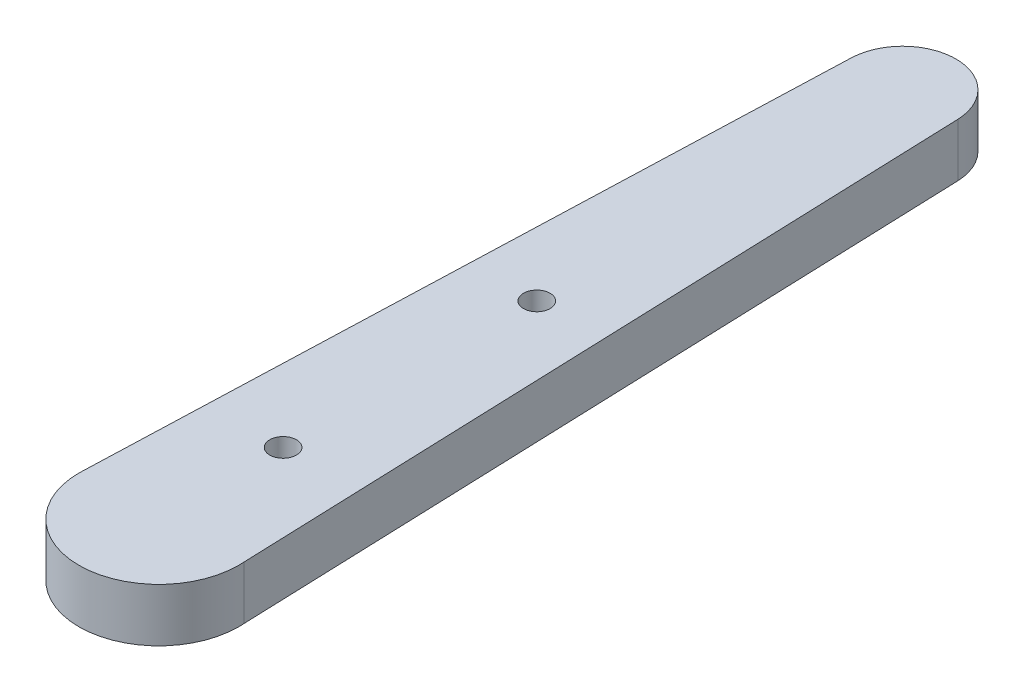
ISO-10303-21;
HEADER;
FILE_DESCRIPTION(('STEP AP214'),'2;1');
FILE_NAME('part.step','',(''),(''),'','','');
FILE_SCHEMA(('AUTOMOTIVE_DESIGN { 1 0 10303 214 1 1 1 1 }'));
ENDSEC;
DATA;
#1=APPLICATION_CONTEXT('core data for automotive mechanical design processes');
#2=APPLICATION_PROTOCOL_DEFINITION('international standard','automotive_design',2000,#1);
#3=PRODUCT_CONTEXT('',#1,'mechanical');
#4=PRODUCT('Part','Part','',(#3));
#5=PRODUCT_RELATED_PRODUCT_CATEGORY('part','',(#4));
#6=PRODUCT_DEFINITION_FORMATION('','',#4);
#7=PRODUCT_DEFINITION_CONTEXT('part definition',#1,'design');
#8=PRODUCT_DEFINITION('design','',#6,#7);
#9=PRODUCT_DEFINITION_SHAPE('','',#8);
#10=(LENGTH_UNIT() NAMED_UNIT(*) SI_UNIT(.MILLI.,.METRE.));
#11=(NAMED_UNIT(*) PLANE_ANGLE_UNIT() SI_UNIT($,.RADIAN.));
#12=(NAMED_UNIT(*) SI_UNIT($,.STERADIAN.) SOLID_ANGLE_UNIT());
#13=UNCERTAINTY_MEASURE_WITH_UNIT(LENGTH_MEASURE(1.E-05),#10,'distance_accuracy_value','');
#14=(GEOMETRIC_REPRESENTATION_CONTEXT(3) GLOBAL_UNCERTAINTY_ASSIGNED_CONTEXT((#13)) GLOBAL_UNIT_ASSIGNED_CONTEXT((#10,
#11,#12)) REPRESENTATION_CONTEXT('',''));
#15=CARTESIAN_POINT('',(0.,0.,0.));
#16=DIRECTION('',(0.,0.,1.));
#17=DIRECTION('',(1.,0.,0.));
#18=AXIS2_PLACEMENT_3D('',#15,#16,#17);
#19=CARTESIAN_POINT('',(0.,2.,0.));
#20=DIRECTION('',(0.,1.,0.));
#21=DIRECTION('',(0.,0.,1.));
#22=AXIS2_PLACEMENT_3D('',#19,#20,#21);
#23=PLANE('',#22);
#24=CARTESIAN_POINT('',(-0.000203324484305146,2.,-14.1900999985433));
#25=DIRECTION('',(0.,1.,0.));
#26=DIRECTION('',(0.,0.,1.));
#27=AXIS2_PLACEMENT_3D('',#24,#25,#26);
#28=CIRCLE('',#27,0.5);
#29=CARTESIAN_POINT('',(-0.000203324484305146,2.,-13.6900999985433));
#30=VERTEX_POINT('',#29);
#31=EDGE_CURVE('E269',#30,#30,#28,.T.);
#32=ORIENTED_EDGE('',*,*,#31,.F.);
#33=EDGE_LOOP('',(#32));
#34=FACE_BOUND('',#33,.T.);
#35=CARTESIAN_POINT('',(-6.68444233435889E-05,2.,-4.6650999995211));
#36=DIRECTION('',(0.,1.,0.));
#37=DIRECTION('',(0.,0.,1.));
#38=AXIS2_PLACEMENT_3D('',#35,#36,#37);
#39=CIRCLE('',#38,0.5);
#40=CARTESIAN_POINT('',(-6.68444233435889E-05,2.,-4.1650999995211));
#41=VERTEX_POINT('',#40);
#42=EDGE_CURVE('E264',#41,#41,#39,.T.);
#43=ORIENTED_EDGE('',*,*,#42,.F.);
#44=EDGE_LOOP('',(#43));
#45=FACE_BOUND('',#44,.T.);
#46=CARTESIAN_POINT('',(-2.99234136236088,2.,-0.214226914985556));
#47=DIRECTION('',(-0.0357284710009022,0.,0.999361534360783));
#48=VECTOR('',#47,1.);
#49=LINE('',#46,#48);
#50=CARTESIAN_POINT('',(-2.99234136236088,2.,-0.214226914985556));
#51=VERTEX_POINT('',#50);
#52=CARTESIAN_POINT('',(-2.99999999999169,2.,-7.06063894732932E-06));
#53=VERTEX_POINT('',#52);
#54=EDGE_CURVE('E11',#51,#53,#49,.T.);
#55=ORIENTED_EDGE('',*,*,#54,.T.);
#56=CARTESIAN_POINT('',(0.,2.,0.));
#57=DIRECTION('',(0.,1.,0.));
#58=DIRECTION('',(0.,0.,1.));
#59=AXIS2_PLACEMENT_3D('',#56,#57,#58);
#60=CIRCLE('',#59,3.);
#61=CARTESIAN_POINT('',(2.99999999999169,2.,7.06063893717848E-06));
#62=VERTEX_POINT('',#61);
#63=EDGE_CURVE('E157',#53,#62,#60,.T.);
#64=ORIENTED_EDGE('',*,*,#63,.T.);
#65=CARTESIAN_POINT('',(2.99999999999169,2.,7.06063893724624E-06));
#66=DIRECTION('',(-0.0357569907916927,0.,-0.999360514333803));
#67=VECTOR('',#66,1.);
#68=LINE('',#65,#67);
#69=CARTESIAN_POINT('',(2.99232812103734,2.,-0.214411790835103));
#70=VERTEX_POINT('',#69);
#71=EDGE_CURVE('E52',#62,#70,#68,.T.);
#72=ORIENTED_EDGE('',*,*,#71,.T.);
#73=DIRECTION('',(-0.0357569907916934,0.,-0.999360514333803));
#74=VECTOR('',#73,1.);
#75=CARTESIAN_POINT('',(2.99616406051452,2.,-0.107202365098083));
#76=LINE('',#75,#74);
#77=CARTESIAN_POINT('',(1.99832079598374,2.,-27.9955994585597));
#78=VERTEX_POINT('',#77);
#79=EDGE_CURVE('E142',#70,#78,#76,.T.);
#80=ORIENTED_EDGE('',*,*,#79,.T.);
#81=CARTESIAN_POINT('',(-0.000400232683862891,2.,-27.9240854769763));
#82=DIRECTION('',(0.,1.,0.));
#83=DIRECTION('',(0.,0.,1.));
#84=AXIS2_PLACEMENT_3D('',#81,#82,#83);
#85=CIRCLE('',#84,2.);
#86=CARTESIAN_POINT('',(-1.99912330140543,2.,-27.9955424189781));
#87=VERTEX_POINT('',#86);
#88=EDGE_CURVE('E118',#87,#78,#85,.F.);
#89=ORIENTED_EDGE('',*,*,#88,.F.);
#90=DIRECTION('',(0.0357284710009011,0.,-0.999361534360783));
#91=VECTOR('',#90,1.);
#92=CARTESIAN_POINT('',(-2.99617068117629,2.,-0.107116987812252));
#93=LINE('',#92,#91);
#94=EDGE_CURVE('E63',#51,#87,#93,.T.);
#95=ORIENTED_EDGE('',*,*,#94,.F.);
#96=EDGE_LOOP('',(#55,#64,#72,#80,#89,#95));
#97=FACE_BOUND('',#96,.T.);
#98=ADVANCED_FACE('F40',(#34,#45,#97),#23,.T.);
#99=CARTESIAN_POINT('',(0.,0.,0.));
#100=DIRECTION('',(0.,1.,0.));
#101=DIRECTION('',(0.,0.,1.));
#102=AXIS2_PLACEMENT_3D('',#99,#100,#101);
#103=PLANE('',#102);
#104=CARTESIAN_POINT('',(-0.000203324484305146,0.,-14.1900999985433));
#105=DIRECTION('',(0.,1.,0.));
#106=DIRECTION('',(0.,0.,1.));
#107=AXIS2_PLACEMENT_3D('',#104,#105,#106);
#108=CIRCLE('',#107,0.5);
#109=CARTESIAN_POINT('',(-0.000203324484305146,0.,-13.6900999985433));
#110=VERTEX_POINT('',#109);
#111=EDGE_CURVE('E145',#110,#110,#108,.T.);
#112=ORIENTED_EDGE('',*,*,#111,.T.);
#113=EDGE_LOOP('',(#112));
#114=FACE_BOUND('',#113,.T.);
#115=CARTESIAN_POINT('',(-6.68444233435889E-05,0.,-4.6650999995211));
#116=DIRECTION('',(0.,1.,0.));
#117=DIRECTION('',(0.,0.,1.));
#118=AXIS2_PLACEMENT_3D('',#115,#116,#117);
#119=CIRCLE('',#118,0.5);
#120=CARTESIAN_POINT('',(-6.68444233435889E-05,0.,-4.1650999995211));
#121=VERTEX_POINT('',#120);
#122=EDGE_CURVE('E261',#121,#121,#119,.T.);
#123=ORIENTED_EDGE('',*,*,#122,.T.);
#124=EDGE_LOOP('',(#123));
#125=FACE_BOUND('',#124,.T.);
#126=CARTESIAN_POINT('',(0.,0.,0.));
#127=DIRECTION('',(0.,1.,0.));
#128=DIRECTION('',(0.,0.,1.));
#129=AXIS2_PLACEMENT_3D('',#126,#127,#128);
#130=CIRCLE('',#129,3.);
#131=CARTESIAN_POINT('',(-2.99999999999169,0.,-7.06063894732932E-06));
#132=VERTEX_POINT('',#131);
#133=CARTESIAN_POINT('',(2.99999999999169,0.,7.06063893717848E-06));
#134=VERTEX_POINT('',#133);
#135=EDGE_CURVE('E138',#132,#134,#130,.T.);
#136=ORIENTED_EDGE('',*,*,#135,.F.);
#137=CARTESIAN_POINT('',(0.,0.,0.));
#138=DIRECTION('',(0.,1.,0.));
#139=DIRECTION('',(-0.99744712078696,0.,-0.0714089716618521));
#140=AXIS2_PLACEMENT_3D('',#137,#138,#139);
#141=CIRCLE('',#140,3.);
#142=CARTESIAN_POINT('',(-2.99234136236088,0.,-0.214226914985556));
#143=VERTEX_POINT('',#142);
#144=EDGE_CURVE('E214',#143,#132,#141,.T.);
#145=ORIENTED_EDGE('',*,*,#144,.F.);
#146=DIRECTION('',(0.0357284710009011,0.,-0.999361534360783));
#147=VECTOR('',#146,1.);
#148=CARTESIAN_POINT('',(-2.99617068117629,0.,-0.107116987812252));
#149=LINE('',#148,#147);
#150=CARTESIAN_POINT('',(-1.99912330140543,0.,-27.9955424189781));
#151=VERTEX_POINT('',#150);
#152=EDGE_CURVE('E111',#143,#151,#149,.T.);
#153=ORIENTED_EDGE('',*,*,#152,.T.);
#154=CARTESIAN_POINT('',(-0.000400232683862891,0.,-27.9240854769763));
#155=DIRECTION('',(0.,1.,0.));
#156=DIRECTION('',(0.,0.,1.));
#157=AXIS2_PLACEMENT_3D('',#154,#155,#156);
#158=CIRCLE('',#157,2.);
#159=CARTESIAN_POINT('',(1.99832079598374,0.,-27.9955994585597));
#160=VERTEX_POINT('',#159);
#161=EDGE_CURVE('E106',#151,#160,#158,.F.);
#162=ORIENTED_EDGE('',*,*,#161,.T.);
#163=DIRECTION('',(-0.0357569907916934,0.,-0.999360514333803));
#164=VECTOR('',#163,1.);
#165=CARTESIAN_POINT('',(2.99616406051452,0.,-0.107202365098083));
#166=LINE('',#165,#164);
#167=CARTESIAN_POINT('',(2.99232812103734,0.,-0.214411790835103));
#168=VERTEX_POINT('',#167);
#169=EDGE_CURVE('E95',#168,#160,#166,.T.);
#170=ORIENTED_EDGE('',*,*,#169,.F.);
#171=CARTESIAN_POINT('',(0.,0.,0.));
#172=DIRECTION('',(0.,1.,0.));
#173=DIRECTION('',(0.99999999999723,0.,2.35354631244232E-06));
#174=AXIS2_PLACEMENT_3D('',#171,#172,#173);
#175=CIRCLE('',#174,3.);
#176=EDGE_CURVE('E161',#134,#168,#175,.T.);
#177=ORIENTED_EDGE('',*,*,#176,.F.);
#178=EDGE_LOOP('',(#136,#145,#153,#162,#170,#177));
#179=FACE_BOUND('',#178,.T.);
#180=ADVANCED_FACE('F109',(#114,#125,#179),#103,.F.);
#181=CARTESIAN_POINT('',(0.,2.,0.));
#182=DIRECTION('',(0.,-1.,0.));
#183=DIRECTION('',(0.,0.,-1.));
#184=AXIS2_PLACEMENT_3D('',#181,#182,#183);
#185=CYLINDRICAL_SURFACE('',#184,3.);
#186=ORIENTED_EDGE('',*,*,#71,.F.);
#187=ORIENTED_EDGE('',*,*,#63,.F.);
#188=ORIENTED_EDGE('',*,*,#54,.F.);
#189=DIRECTION('',(0.,-1.,0.));
#190=VECTOR('',#189,1.);
#191=CARTESIAN_POINT('',(-2.99234136236088,2.,-0.214226914985556));
#192=LINE('',#191,#190);
#193=EDGE_CURVE('E133',#143,#51,#192,.F.);
#194=ORIENTED_EDGE('',*,*,#193,.F.);
#195=ORIENTED_EDGE('',*,*,#144,.T.);
#196=ORIENTED_EDGE('',*,*,#135,.T.);
#197=ORIENTED_EDGE('',*,*,#176,.T.);
#198=DIRECTION('',(0.,-1.,0.));
#199=VECTOR('',#198,1.);
#200=CARTESIAN_POINT('',(2.99232812103735,2.,-0.214411790835095));
#201=LINE('',#200,#199);
#202=EDGE_CURVE('E102',#168,#70,#201,.F.);
#203=ORIENTED_EDGE('',*,*,#202,.T.);
#204=EDGE_LOOP('',(#186,#187,#188,#194,#195,#196,#197,#203));
#205=FACE_BOUND('',#204,.T.);
#206=ADVANCED_FACE('F42',(#205),#185,.T.);
#207=CARTESIAN_POINT('',(-2.99617068117629,0.,-0.107116987812252));
#208=DIRECTION('',(0.999361534360783,0.,0.0357284710009011));
#209=DIRECTION('',(0.0357284710009011,0.,-0.999361534360783));
#210=AXIS2_PLACEMENT_3D('',#207,#208,#209);
#211=PLANE('',#210);
#212=ORIENTED_EDGE('',*,*,#152,.F.);
#213=ORIENTED_EDGE('',*,*,#193,.T.);
#214=ORIENTED_EDGE('',*,*,#94,.T.);
#215=DIRECTION('',(0.,1.,0.));
#216=VECTOR('',#215,1.);
#217=CARTESIAN_POINT('',(-1.99912330140543,0.,-27.9955424189781));
#218=LINE('',#217,#216);
#219=EDGE_CURVE('E120',#151,#87,#218,.T.);
#220=ORIENTED_EDGE('',*,*,#219,.F.);
#221=EDGE_LOOP('',(#212,#213,#214,#220));
#222=FACE_BOUND('',#221,.T.);
#223=ADVANCED_FACE('F235',(#222),#211,.F.);
#224=CARTESIAN_POINT('',(2.99616406051452,0.,-0.107202365098083));
#225=DIRECTION('',(0.999360514333803,0.,-0.0357569907916934));
#226=DIRECTION('',(-0.0357569907916934,0.,-0.999360514333803));
#227=AXIS2_PLACEMENT_3D('',#224,#225,#226);
#228=PLANE('',#227);
#229=ORIENTED_EDGE('',*,*,#202,.F.);
#230=ORIENTED_EDGE('',*,*,#169,.T.);
#231=DIRECTION('',(0.,1.,0.));
#232=VECTOR('',#231,1.);
#233=CARTESIAN_POINT('',(1.99832079598374,0.,-27.9955994585597));
#234=LINE('',#233,#232);
#235=EDGE_CURVE('E99',#160,#78,#234,.T.);
#236=ORIENTED_EDGE('',*,*,#235,.T.);
#237=ORIENTED_EDGE('',*,*,#79,.F.);
#238=EDGE_LOOP('',(#229,#230,#236,#237));
#239=FACE_BOUND('',#238,.T.);
#240=ADVANCED_FACE('F97',(#239),#228,.T.);
#241=CARTESIAN_POINT('',(-0.000400232683862891,0.,-27.9240854769763));
#242=DIRECTION('',(0.,1.,0.));
#243=DIRECTION('',(0.,0.,1.));
#244=AXIS2_PLACEMENT_3D('',#241,#242,#243);
#245=CYLINDRICAL_SURFACE('',#244,2.);
#246=ORIENTED_EDGE('',*,*,#88,.T.);
#247=ORIENTED_EDGE('',*,*,#235,.F.);
#248=ORIENTED_EDGE('',*,*,#161,.F.);
#249=ORIENTED_EDGE('',*,*,#219,.T.);
#250=EDGE_LOOP('',(#246,#247,#248,#249));
#251=FACE_BOUND('',#250,.T.);
#252=ADVANCED_FACE('F117',(#251),#245,.T.);
#253=CARTESIAN_POINT('',(-6.68444233435889E-05,0.,-4.6650999995211));
#254=DIRECTION('',(0.,1.,0.));
#255=DIRECTION('',(0.,0.,1.));
#256=AXIS2_PLACEMENT_3D('',#253,#254,#255);
#257=CYLINDRICAL_SURFACE('',#256,0.5);
#258=ORIENTED_EDGE('',*,*,#122,.F.);
#259=EDGE_LOOP('',(#258));
#260=FACE_BOUND('',#259,.T.);
#261=ORIENTED_EDGE('',*,*,#42,.T.);
#262=EDGE_LOOP('',(#261));
#263=FACE_BOUND('',#262,.T.);
#264=ADVANCED_FACE('F246',(#260,#263),#257,.F.);
#265=CARTESIAN_POINT('',(-0.000203324484305146,0.,-14.1900999985433));
#266=DIRECTION('',(0.,1.,0.));
#267=DIRECTION('',(0.,0.,1.));
#268=AXIS2_PLACEMENT_3D('',#265,#266,#267);
#269=CYLINDRICAL_SURFACE('',#268,0.5);
#270=ORIENTED_EDGE('',*,*,#111,.F.);
#271=EDGE_LOOP('',(#270));
#272=FACE_BOUND('',#271,.T.);
#273=ORIENTED_EDGE('',*,*,#31,.T.);
#274=EDGE_LOOP('',(#273));
#275=FACE_BOUND('',#274,.T.);
#276=ADVANCED_FACE('F252',(#272,#275),#269,.F.);
#277=CLOSED_SHELL('',(#98,#180,#206,#223,#240,#252,#264,#276));
#278=MANIFOLD_SOLID_BREP('B2',#277);
#279=ADVANCED_BREP_SHAPE_REPRESENTATION('',(#18,#278),#14);
#280=SHAPE_DEFINITION_REPRESENTATION(#9,#279);
ENDSEC;
END-ISO-10303-21;
